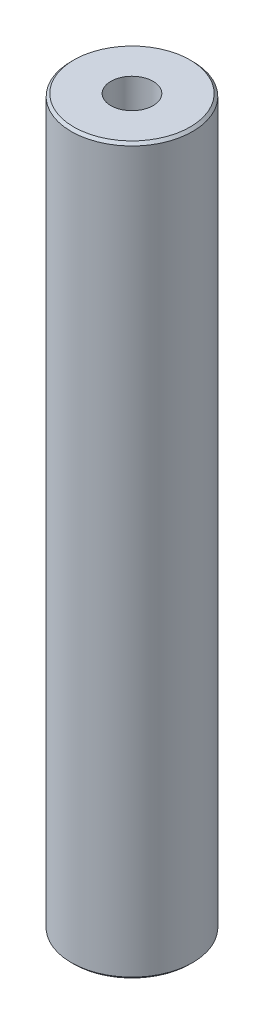
ISO-10303-21;
HEADER;
FILE_DESCRIPTION(('STEP AP214'),'2;1');
FILE_NAME('part.step','',(''),(''),'','','');
FILE_SCHEMA(('AUTOMOTIVE_DESIGN { 1 0 10303 214 1 1 1 1 }'));
ENDSEC;
DATA;
#1=APPLICATION_CONTEXT('core data for automotive mechanical design processes');
#2=APPLICATION_PROTOCOL_DEFINITION('international standard','automotive_design',2000,#1);
#3=PRODUCT_CONTEXT('',#1,'mechanical');
#4=PRODUCT('Part','Part','',(#3));
#5=PRODUCT_RELATED_PRODUCT_CATEGORY('part','',(#4));
#6=PRODUCT_DEFINITION_FORMATION('','',#4);
#7=PRODUCT_DEFINITION_CONTEXT('part definition',#1,'design');
#8=PRODUCT_DEFINITION('design','',#6,#7);
#9=PRODUCT_DEFINITION_SHAPE('','',#8);
#10=(LENGTH_UNIT() NAMED_UNIT(*) SI_UNIT(.MILLI.,.METRE.));
#11=(NAMED_UNIT(*) PLANE_ANGLE_UNIT() SI_UNIT($,.RADIAN.));
#12=(NAMED_UNIT(*) SI_UNIT($,.STERADIAN.) SOLID_ANGLE_UNIT());
#13=UNCERTAINTY_MEASURE_WITH_UNIT(LENGTH_MEASURE(1.E-05),#10,'distance_accuracy_value','');
#14=(GEOMETRIC_REPRESENTATION_CONTEXT(3) GLOBAL_UNCERTAINTY_ASSIGNED_CONTEXT((#13)) GLOBAL_UNIT_ASSIGNED_CONTEXT((#10,
#11,#12)) REPRESENTATION_CONTEXT('',''));
#15=CARTESIAN_POINT('',(0.,0.,0.));
#16=DIRECTION('',(0.,0.,1.));
#17=DIRECTION('',(1.,0.,0.));
#18=AXIS2_PLACEMENT_3D('',#15,#16,#17);
#19=CARTESIAN_POINT('',(0.,596.948046330472,0.));
#20=DIRECTION('',(0.,-1.,0.));
#21=DIRECTION('',(0.,0.,-1.));
#22=AXIS2_PLACEMENT_3D('',#19,#20,#21);
#23=CYLINDRICAL_SURFACE('',#22,50.);
#24=CARTESIAN_POINT('',(0.,594.827269458709,0.));
#25=DIRECTION('',(0.,1.,0.));
#26=DIRECTION('',(0.,0.,1.));
#27=AXIS2_PLACEMENT_3D('',#24,#25,#26);
#28=CIRCLE('',#27,50.);
#29=CARTESIAN_POINT('',(0.,594.827269458709,50.));
#30=VERTEX_POINT('',#29);
#31=EDGE_CURVE('E50',#30,#30,#28,.F.);
#32=ORIENTED_EDGE('',*,*,#31,.T.);
#33=EDGE_LOOP('',(#32));
#34=FACE_BOUND('',#33,.T.);
#35=CARTESIAN_POINT('',(0.,2.12077687176304,0.));
#36=DIRECTION('',(0.,1.,0.));
#37=DIRECTION('',(0.,0.,1.));
#38=AXIS2_PLACEMENT_3D('',#35,#36,#37);
#39=CIRCLE('',#38,50.);
#40=CARTESIAN_POINT('',(0.,2.12077687176304,50.));
#41=VERTEX_POINT('',#40);
#42=EDGE_CURVE('E51',#41,#41,#39,.T.);
#43=ORIENTED_EDGE('',*,*,#42,.T.);
#44=EDGE_LOOP('',(#43));
#45=FACE_BOUND('',#44,.T.);
#46=ADVANCED_FACE('F39',(#34,#45),#23,.T.);
#47=CARTESIAN_POINT('',(0.,596.948046330472,0.));
#48=DIRECTION('',(0.,1.,0.));
#49=DIRECTION('',(0.,0.,1.));
#50=AXIS2_PLACEMENT_3D('',#47,#48,#49);
#51=PLANE('',#50);
#52=CARTESIAN_POINT('',(0.,596.948046330472,0.));
#53=DIRECTION('',(0.,1.,0.));
#54=DIRECTION('',(0.,0.,1.));
#55=AXIS2_PLACEMENT_3D('',#52,#53,#54);
#56=CIRCLE('',#55,47.8792231282368);
#57=CARTESIAN_POINT('',(0.,596.948046330472,47.8792231282368));
#58=VERTEX_POINT('',#57);
#59=EDGE_CURVE('E54',#58,#58,#56,.T.);
#60=ORIENTED_EDGE('',*,*,#59,.T.);
#61=EDGE_LOOP('',(#60));
#62=FACE_BOUND('',#61,.T.);
#63=CARTESIAN_POINT('',(0.,596.948046330472,0.));
#64=DIRECTION('',(0.,1.,0.));
#65=DIRECTION('',(0.,0.,1.));
#66=AXIS2_PLACEMENT_3D('',#63,#64,#65);
#67=CIRCLE('',#66,17.3983747108028);
#68=CARTESIAN_POINT('',(0.,596.948046330472,17.3983747108028));
#69=VERTEX_POINT('',#68);
#70=EDGE_CURVE('E58',#69,#69,#67,.T.);
#71=ORIENTED_EDGE('',*,*,#70,.F.);
#72=EDGE_LOOP('',(#71));
#73=FACE_BOUND('',#72,.T.);
#74=ADVANCED_FACE('F69',(#62,#73),#51,.T.);
#75=CARTESIAN_POINT('',(0.,0.,0.));
#76=DIRECTION('',(0.,1.,0.));
#77=DIRECTION('',(0.,0.,1.));
#78=AXIS2_PLACEMENT_3D('',#75,#76,#77);
#79=PLANE('',#78);
#80=CARTESIAN_POINT('',(0.,0.,0.));
#81=DIRECTION('',(0.,1.,0.));
#82=DIRECTION('',(0.,0.,1.));
#83=AXIS2_PLACEMENT_3D('',#80,#81,#82);
#84=CIRCLE('',#83,47.879223128237);
#85=CARTESIAN_POINT('',(0.,0.,47.879223128237));
#86=VERTEX_POINT('',#85);
#87=EDGE_CURVE('E10',#86,#86,#84,.F.);
#88=ORIENTED_EDGE('',*,*,#87,.T.);
#89=EDGE_LOOP('',(#88));
#90=FACE_BOUND('',#89,.T.);
#91=CARTESIAN_POINT('',(0.,0.,0.));
#92=DIRECTION('',(0.,1.,0.));
#93=DIRECTION('',(0.,0.,1.));
#94=AXIS2_PLACEMENT_3D('',#91,#92,#93);
#95=CIRCLE('',#94,17.3983747108028);
#96=CARTESIAN_POINT('',(0.,0.,17.3983747108028));
#97=VERTEX_POINT('',#96);
#98=EDGE_CURVE('E63',#97,#97,#95,.T.);
#99=ORIENTED_EDGE('',*,*,#98,.T.);
#100=EDGE_LOOP('',(#99));
#101=FACE_BOUND('',#100,.T.);
#102=ADVANCED_FACE('F75',(#90,#101),#79,.F.);
#103=CARTESIAN_POINT('',(0.,596.948046330472,0.));
#104=DIRECTION('',(0.,-1.,0.));
#105=DIRECTION('',(0.,0.,-1.));
#106=AXIS2_PLACEMENT_3D('',#103,#104,#105);
#107=CYLINDRICAL_SURFACE('',#106,17.3983747108028);
#108=ORIENTED_EDGE('',*,*,#70,.T.);
#109=EDGE_LOOP('',(#108));
#110=FACE_BOUND('',#109,.T.);
#111=ORIENTED_EDGE('',*,*,#98,.F.);
#112=EDGE_LOOP('',(#111));
#113=FACE_BOUND('',#112,.T.);
#114=ADVANCED_FACE('F70',(#110,#113),#107,.F.);
#115=CARTESIAN_POINT('',(0.,596.948046330472,0.));
#116=DIRECTION('',(0.,-1.,0.));
#117=DIRECTION('',(0.,0.,-1.));
#118=AXIS2_PLACEMENT_3D('',#115,#116,#117);
#119=CONICAL_SURFACE('',#118,47.8792231282368,0.785398163397451);
#120=ORIENTED_EDGE('',*,*,#31,.F.);
#121=EDGE_LOOP('',(#120));
#122=FACE_BOUND('',#121,.T.);
#123=ORIENTED_EDGE('',*,*,#59,.F.);
#124=EDGE_LOOP('',(#123));
#125=FACE_BOUND('',#124,.T.);
#126=ADVANCED_FACE('F81',(#122,#125),#119,.T.);
#127=CARTESIAN_POINT('',(0.,2.12077687176304,0.));
#128=DIRECTION('',(0.,1.,0.));
#129=DIRECTION('',(0.,0.,1.));
#130=AXIS2_PLACEMENT_3D('',#127,#128,#129);
#131=CONICAL_SURFACE('',#130,50.,0.78539816339745);
#132=ORIENTED_EDGE('',*,*,#87,.F.);
#133=EDGE_LOOP('',(#132));
#134=FACE_BOUND('',#133,.T.);
#135=ORIENTED_EDGE('',*,*,#42,.F.);
#136=EDGE_LOOP('',(#135));
#137=FACE_BOUND('',#136,.T.);
#138=ADVANCED_FACE('F45',(#134,#137),#131,.T.);
#139=CLOSED_SHELL('',(#46,#74,#102,#114,#126,#138));
#140=MANIFOLD_SOLID_BREP('B2',#139);
#141=ADVANCED_BREP_SHAPE_REPRESENTATION('',(#18,#140),#14);
#142=SHAPE_DEFINITION_REPRESENTATION(#9,#141);
ENDSEC;
END-ISO-10303-21;
